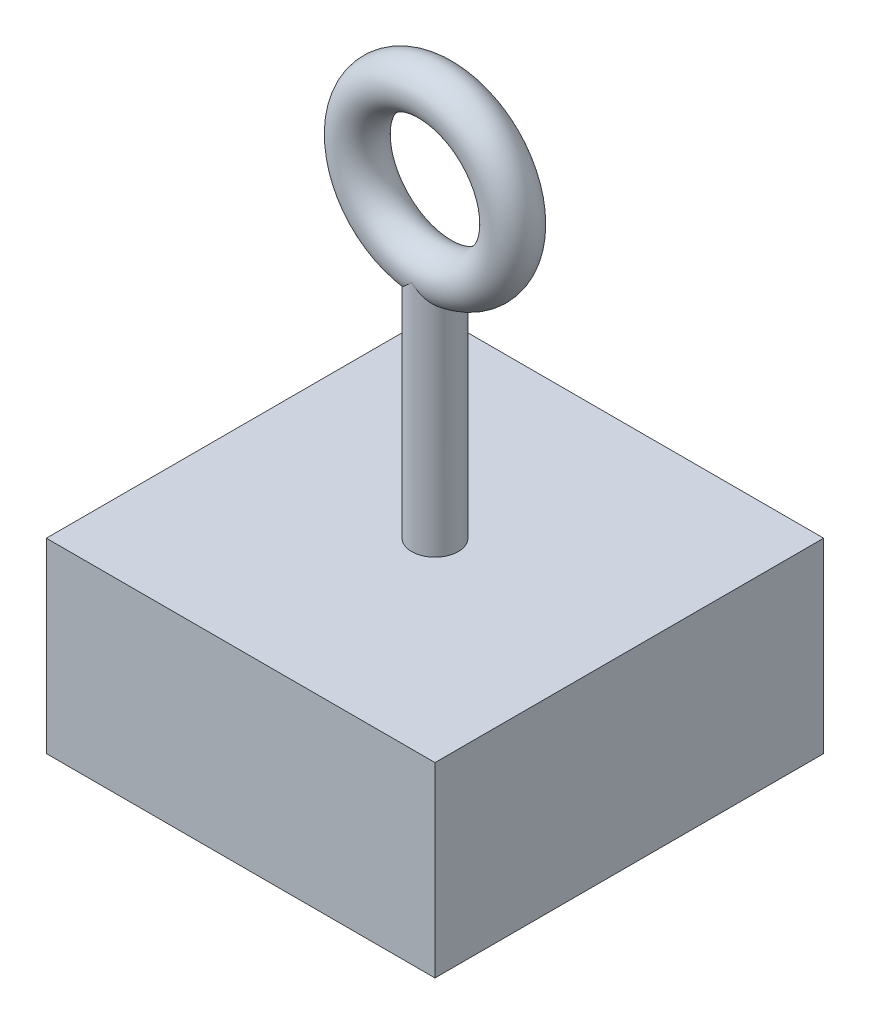
ISO-10303-21;
HEADER;
FILE_DESCRIPTION(('STEP AP214'),'2;1');
FILE_NAME('part.step','',(''),(''),'','','');
FILE_SCHEMA(('AUTOMOTIVE_DESIGN { 1 0 10303 214 1 1 1 1 }'));
ENDSEC;
DATA;
#1=APPLICATION_CONTEXT('core data for automotive mechanical design processes');
#2=APPLICATION_PROTOCOL_DEFINITION('international standard','automotive_design',2000,#1);
#3=PRODUCT_CONTEXT('',#1,'mechanical');
#4=PRODUCT('Part','Part','',(#3));
#5=PRODUCT_RELATED_PRODUCT_CATEGORY('part','',(#4));
#6=PRODUCT_DEFINITION_FORMATION('','',#4);
#7=PRODUCT_DEFINITION_CONTEXT('part definition',#1,'design');
#8=PRODUCT_DEFINITION('design','',#6,#7);
#9=PRODUCT_DEFINITION_SHAPE('','',#8);
#10=(LENGTH_UNIT() NAMED_UNIT(*) SI_UNIT(.MILLI.,.METRE.));
#11=(NAMED_UNIT(*) PLANE_ANGLE_UNIT() SI_UNIT($,.RADIAN.));
#12=(NAMED_UNIT(*) SI_UNIT($,.STERADIAN.) SOLID_ANGLE_UNIT());
#13=UNCERTAINTY_MEASURE_WITH_UNIT(LENGTH_MEASURE(1.E-05),#10,'distance_accuracy_value','');
#14=(GEOMETRIC_REPRESENTATION_CONTEXT(3) GLOBAL_UNCERTAINTY_ASSIGNED_CONTEXT((#13)) GLOBAL_UNIT_ASSIGNED_CONTEXT((#10,
#11,#12)) REPRESENTATION_CONTEXT('',''));
#15=CARTESIAN_POINT('',(0.,0.,0.));
#16=DIRECTION('',(0.,0.,1.));
#17=DIRECTION('',(1.,0.,0.));
#18=AXIS2_PLACEMENT_3D('',#15,#16,#17);
#19=CARTESIAN_POINT('',(-12.5,12.,12.5));
#20=DIRECTION('',(1.,0.,0.));
#21=DIRECTION('',(0.,0.,-1.));
#22=AXIS2_PLACEMENT_3D('',#19,#20,#21);
#23=PLANE('',#22);
#24=DIRECTION('',(0.,0.,1.));
#25=VECTOR('',#24,1.);
#26=CARTESIAN_POINT('',(-12.5,0.,12.5));
#27=LINE('',#26,#25);
#28=CARTESIAN_POINT('',(-12.5,0.,-12.5));
#29=VERTEX_POINT('',#28);
#30=CARTESIAN_POINT('',(-12.5,0.,12.5));
#31=VERTEX_POINT('',#30);
#32=EDGE_CURVE('E104',#29,#31,#27,.T.);
#33=ORIENTED_EDGE('',*,*,#32,.T.);
#34=DIRECTION('',(0.,-1.,0.));
#35=VECTOR('',#34,1.);
#36=CARTESIAN_POINT('',(-12.5,12.,12.5));
#37=LINE('',#36,#35);
#38=CARTESIAN_POINT('',(-12.5,12.,12.5));
#39=VERTEX_POINT('',#38);
#40=EDGE_CURVE('E11',#39,#31,#37,.T.);
#41=ORIENTED_EDGE('',*,*,#40,.F.);
#42=DIRECTION('',(0.,0.,1.));
#43=VECTOR('',#42,1.);
#44=CARTESIAN_POINT('',(-12.5,12.,12.5));
#45=LINE('',#44,#43);
#46=CARTESIAN_POINT('',(-12.5,12.,-12.5));
#47=VERTEX_POINT('',#46);
#48=EDGE_CURVE('E152',#47,#39,#45,.T.);
#49=ORIENTED_EDGE('',*,*,#48,.F.);
#50=DIRECTION('',(0.,-1.,0.));
#51=VECTOR('',#50,1.);
#52=CARTESIAN_POINT('',(-12.5,12.,-12.5));
#53=LINE('',#52,#51);
#54=EDGE_CURVE('E137',#47,#29,#53,.T.);
#55=ORIENTED_EDGE('',*,*,#54,.T.);
#56=EDGE_LOOP('',(#33,#41,#49,#55));
#57=FACE_BOUND('',#56,.T.);
#58=ADVANCED_FACE('F39',(#57),#23,.F.);
#59=CARTESIAN_POINT('',(12.5,12.,12.5));
#60=DIRECTION('',(0.,0.,-1.));
#61=DIRECTION('',(-1.,0.,0.));
#62=AXIS2_PLACEMENT_3D('',#59,#60,#61);
#63=PLANE('',#62);
#64=DIRECTION('',(1.,0.,0.));
#65=VECTOR('',#64,1.);
#66=CARTESIAN_POINT('',(12.5,0.,12.5));
#67=LINE('',#66,#65);
#68=CARTESIAN_POINT('',(12.5,0.,12.5));
#69=VERTEX_POINT('',#68);
#70=EDGE_CURVE('E140',#31,#69,#67,.T.);
#71=ORIENTED_EDGE('',*,*,#70,.T.);
#72=DIRECTION('',(0.,-1.,0.));
#73=VECTOR('',#72,1.);
#74=CARTESIAN_POINT('',(12.5,12.,12.5));
#75=LINE('',#74,#73);
#76=CARTESIAN_POINT('',(12.5,12.,12.5));
#77=VERTEX_POINT('',#76);
#78=EDGE_CURVE('E47',#77,#69,#75,.T.);
#79=ORIENTED_EDGE('',*,*,#78,.F.);
#80=DIRECTION('',(1.,0.,0.));
#81=VECTOR('',#80,1.);
#82=CARTESIAN_POINT('',(12.5,12.,12.5));
#83=LINE('',#82,#81);
#84=EDGE_CURVE('E90',#39,#77,#83,.T.);
#85=ORIENTED_EDGE('',*,*,#84,.F.);
#86=ORIENTED_EDGE('',*,*,#40,.T.);
#87=EDGE_LOOP('',(#71,#79,#85,#86));
#88=FACE_BOUND('',#87,.T.);
#89=ADVANCED_FACE('F127',(#88),#63,.F.);
#90=CARTESIAN_POINT('',(12.5,12.,12.5));
#91=DIRECTION('',(-1.,0.,0.));
#92=DIRECTION('',(0.,0.,1.));
#93=AXIS2_PLACEMENT_3D('',#90,#91,#92);
#94=PLANE('',#93);
#95=DIRECTION('',(0.,0.,-1.));
#96=VECTOR('',#95,1.);
#97=CARTESIAN_POINT('',(12.5,0.,12.5));
#98=LINE('',#97,#96);
#99=CARTESIAN_POINT('',(12.5,0.,-12.5));
#100=VERTEX_POINT('',#99);
#101=EDGE_CURVE('E143',#69,#100,#98,.T.);
#102=ORIENTED_EDGE('',*,*,#101,.T.);
#103=DIRECTION('',(0.,-1.,0.));
#104=VECTOR('',#103,1.);
#105=CARTESIAN_POINT('',(12.5,12.,-12.5));
#106=LINE('',#105,#104);
#107=CARTESIAN_POINT('',(12.5,12.,-12.5));
#108=VERTEX_POINT('',#107);
#109=EDGE_CURVE('E155',#108,#100,#106,.T.);
#110=ORIENTED_EDGE('',*,*,#109,.F.);
#111=DIRECTION('',(0.,0.,-1.));
#112=VECTOR('',#111,1.);
#113=CARTESIAN_POINT('',(12.5,12.,12.5));
#114=LINE('',#113,#112);
#115=EDGE_CURVE('E163',#77,#108,#114,.T.);
#116=ORIENTED_EDGE('',*,*,#115,.F.);
#117=ORIENTED_EDGE('',*,*,#78,.T.);
#118=EDGE_LOOP('',(#102,#110,#116,#117));
#119=FACE_BOUND('',#118,.T.);
#120=ADVANCED_FACE('F132',(#119),#94,.F.);
#121=CARTESIAN_POINT('',(12.5,12.,-12.5));
#122=DIRECTION('',(0.,0.,1.));
#123=DIRECTION('',(1.,0.,0.));
#124=AXIS2_PLACEMENT_3D('',#121,#122,#123);
#125=PLANE('',#124);
#126=DIRECTION('',(-1.,0.,0.));
#127=VECTOR('',#126,1.);
#128=CARTESIAN_POINT('',(12.5,0.,-12.5));
#129=LINE('',#128,#127);
#130=EDGE_CURVE('E83',#100,#29,#129,.T.);
#131=ORIENTED_EDGE('',*,*,#130,.T.);
#132=ORIENTED_EDGE('',*,*,#54,.F.);
#133=DIRECTION('',(-1.,0.,0.));
#134=VECTOR('',#133,1.);
#135=CARTESIAN_POINT('',(12.5,12.,-12.5));
#136=LINE('',#135,#134);
#137=EDGE_CURVE('E62',#108,#47,#136,.T.);
#138=ORIENTED_EDGE('',*,*,#137,.F.);
#139=ORIENTED_EDGE('',*,*,#109,.T.);
#140=EDGE_LOOP('',(#131,#132,#138,#139));
#141=FACE_BOUND('',#140,.T.);
#142=ADVANCED_FACE('F170',(#141),#125,.F.);
#143=CARTESIAN_POINT('',(0.,12.,0.));
#144=DIRECTION('',(0.,1.,0.));
#145=DIRECTION('',(0.,0.,1.));
#146=AXIS2_PLACEMENT_3D('',#143,#144,#145);
#147=PLANE('',#146);
#148=CARTESIAN_POINT('',(0.,12.,0.));
#149=DIRECTION('',(0.,1.,0.));
#150=DIRECTION('',(0.,0.,1.));
#151=AXIS2_PLACEMENT_3D('',#148,#149,#150);
#152=CIRCLE('',#151,1.5);
#153=CARTESIAN_POINT('',(0.,12.,1.5));
#154=VERTEX_POINT('',#153);
#155=EDGE_CURVE('E100',#154,#154,#152,.T.);
#156=ORIENTED_EDGE('',*,*,#155,.F.);
#157=EDGE_LOOP('',(#156));
#158=FACE_BOUND('',#157,.T.);
#159=ORIENTED_EDGE('',*,*,#48,.T.);
#160=ORIENTED_EDGE('',*,*,#84,.T.);
#161=ORIENTED_EDGE('',*,*,#115,.T.);
#162=ORIENTED_EDGE('',*,*,#137,.T.);
#163=EDGE_LOOP('',(#159,#160,#161,#162));
#164=FACE_BOUND('',#163,.T.);
#165=ADVANCED_FACE('F165',(#158,#164),#147,.T.);
#166=CARTESIAN_POINT('',(0.,0.,0.));
#167=DIRECTION('',(0.,1.,0.));
#168=DIRECTION('',(0.,0.,1.));
#169=AXIS2_PLACEMENT_3D('',#166,#167,#168);
#170=PLANE('',#169);
#171=ORIENTED_EDGE('',*,*,#32,.F.);
#172=ORIENTED_EDGE('',*,*,#130,.F.);
#173=ORIENTED_EDGE('',*,*,#101,.F.);
#174=ORIENTED_EDGE('',*,*,#70,.F.);
#175=EDGE_LOOP('',(#171,#172,#173,#174));
#176=FACE_BOUND('',#175,.T.);
#177=ADVANCED_FACE('F125',(#176),#170,.F.);
#178=CARTESIAN_POINT('',(0.,27.,0.));
#179=DIRECTION('',(0.,-1.,0.));
#180=DIRECTION('',(0.,0.,-1.));
#181=AXIS2_PLACEMENT_3D('',#178,#179,#180);
#182=CYLINDRICAL_SURFACE('',#181,1.5);
#183=CARTESIAN_POINT('',(0.,26.999999906,-1.50000000000002));
#184=CARTESIAN_POINT('',(0.00182568963583566,26.9981742102942,-1.49999999734486));
#185=CARTESIAN_POINT('',(0.00365193432677595,26.9963489657987,-1.49999666428704));
#186=CARTESIAN_POINT('',(0.0949131750784535,26.9051878507825,-1.49966346032787));
#187=CARTESIAN_POINT('',(0.185655647360203,26.8169499783912,-1.49133942554492));
#188=CARTESIAN_POINT('',(0.367724582442865,26.6441881953785,-1.45718060292192));
#189=CARTESIAN_POINT('',(0.459051776626769,26.5596708658237,-1.43131601718542));
#190=CARTESIAN_POINT('',(0.628438957786914,26.4062946842608,-1.3646638731951));
#191=CARTESIAN_POINT('',(0.706760542964749,26.3367821829243,-1.32607642679257));
#192=CARTESIAN_POINT('',(0.859003198743123,26.2039299155861,-1.2329046127736));
#193=CARTESIAN_POINT('',(0.932930737295943,26.1405809847345,-1.17834449528794));
#194=CARTESIAN_POINT('',(1.05828674399811,26.0346779581032,-1.06563374382396));
#195=CARTESIAN_POINT('',(1.11118877923404,25.9905445548412,-1.01061522778142));
#196=CARTESIAN_POINT('',(1.20984551442828,25.9090136999866,-0.890121431120688));
#197=CARTESIAN_POINT('',(1.25560795085607,25.8716089504015,-0.824657626869593));
#198=CARTESIAN_POINT('',(1.33071822817451,25.8106576573649,-0.695570345171387));
#199=CARTESIAN_POINT('',(1.36152672735676,25.7858449802986,-0.633398746028195));
#200=CARTESIAN_POINT('',(1.41477797907457,25.7431446830224,-0.503321177727648));
#201=CARTESIAN_POINT('',(1.43722443657645,25.7252539957535,-0.435417764559651));
#202=CARTESIAN_POINT('',(1.47245202060871,25.6972449045988,-0.295186793571588));
#203=CARTESIAN_POINT('',(1.48518253236534,25.6871671978303,-0.222838160969745));
#204=CARTESIAN_POINT('',(1.49985819047012,25.6755538542848,-0.0763806352275474));
#205=CARTESIAN_POINT('',(1.50180734814341,25.674015040515,-0.0022724070727229));
#206=CARTESIAN_POINT('',(1.49511135607249,25.6793103170989,0.138366612430237));
#207=CARTESIAN_POINT('',(1.48741234238786,25.6853966426296,0.204974299762338));
#208=CARTESIAN_POINT('',(1.46347911866601,25.7043760013652,0.335617584354094));
#209=CARTESIAN_POINT('',(1.44724496675342,25.7172689882166,0.399653199126464));
#210=CARTESIAN_POINT('',(1.40688370679557,25.7494721311657,0.524441138036077));
#211=CARTESIAN_POINT('',(1.38265491168221,25.7688650150094,0.585138746008906));
#212=CARTESIAN_POINT('',(1.32756220644451,25.8132306918863,0.701221691754634));
#213=CARTESIAN_POINT('',(1.29669630268246,25.838205161591,0.756605426114912));
#214=CARTESIAN_POINT('',(1.22541017424457,25.89630891705,0.867906278731232));
#215=CARTESIAN_POINT('',(1.18427985829053,25.9300653405413,0.923038306226988));
#216=CARTESIAN_POINT('',(1.09686884122815,26.0025000301075,1.02538685867852));
#217=CARTESIAN_POINT('',(1.0505845310859,26.0411817478249,1.07259777822783));
#218=CARTESIAN_POINT('',(0.930175018903906,26.1429138523676,1.18076357991972));
#219=CARTESIAN_POINT('',(0.853707660471543,26.2084725469941,1.23677463233508));
#220=CARTESIAN_POINT('',(0.696174115013345,26.346107412551,1.33185663766157));
#221=CARTESIAN_POINT('',(0.615098127813316,26.418197681872,1.37088983809151));
#222=CARTESIAN_POINT('',(0.445515047403088,26.5721568043537,1.43537760819614));
#223=CARTESIAN_POINT('',(0.356884072533818,26.6543569901975,1.45969517804686));
#224=CARTESIAN_POINT('',(0.180252860107695,26.8222052321371,1.49182713382793));
#225=CARTESIAN_POINT('',(0.0922517374151249,26.9078463542816,1.49967316426294));
#226=CARTESIAN_POINT('',(0.00365193571746469,26.9963489645857,1.49999666456257));
#227=CARTESIAN_POINT('',(0.00182569104588028,26.998174209106,1.49999999763108));
#228=CARTESIAN_POINT('',(0.,26.999999906,1.50000000000002));
#229=B_SPLINE_CURVE_WITH_KNOTS('',3,(#183,#184,#185,#186,#187,#188,#189,#190,#191,#192,#193,
#194,#195,#196,#197,#198,#199,#200,#201,#202,#203,#204,#205,#206,#207,#208,#209,#210,#211,#212,
#213,#214,#215,#216,#217,#218,#219,#220,#221,#222,#223,#224,#225,#226,#227,#228),.UNSPECIFIED.,
.F.,.F.,(4,2,2,2,2,2,2,2,2,2,2,2,2,2,2,2,2,2,2,2,2,2,4),(0.,0.00774597344465398,
0.386966746084224,0.766833358281173,1.10045393892643,1.43357061177684,1.69708534297103,
1.96031251607551,2.1804647055462,2.40051923593788,2.62171244971653,2.84282336051105,
3.04385215262425,3.24487957574144,3.44856941372013,3.65232052121314,3.88133136465765,
4.11050359127406,4.45435145777399,4.79896005423369,5.16760494395127,5.53554095635558,
5.54328692980489),.UNSPECIFIED.);
#230=CARTESIAN_POINT('',(0.,27.,-1.5));
#231=VERTEX_POINT('',#230);
#232=CARTESIAN_POINT('',(0.,27.,1.5));
#233=VERTEX_POINT('',#232);
#234=EDGE_CURVE('E92',#231,#233,#229,.T.);
#235=ORIENTED_EDGE('',*,*,#234,.T.);
#236=CARTESIAN_POINT('',(0.,26.999999906,1.50000000000002));
#237=CARTESIAN_POINT('',(-0.00182568963583565,26.9981742102942,1.49999999734486));
#238=CARTESIAN_POINT('',(-0.00365193432677593,26.9963489657987,1.49999666428704));
#239=CARTESIAN_POINT('',(-0.094913175078453,26.9051878507825,1.49966346032787));
#240=CARTESIAN_POINT('',(-0.185655647360201,26.8169499783912,1.49133942554492));
#241=CARTESIAN_POINT('',(-0.367724582442864,26.6441881953785,1.45718060292192));
#242=CARTESIAN_POINT('',(-0.459051776626767,26.5596708658237,1.43131601718542));
#243=CARTESIAN_POINT('',(-0.628438957786911,26.4062946842608,1.3646638731951));
#244=CARTESIAN_POINT('',(-0.706760542964746,26.3367821829243,1.32607642679257));
#245=CARTESIAN_POINT('',(-0.85900319874312,26.2039299155861,1.2329046127736));
#246=CARTESIAN_POINT('',(-0.93293073729594,26.1405809847345,1.17834449528794));
#247=CARTESIAN_POINT('',(-1.0582867439981,26.0346779581032,1.06563374382397));
#248=CARTESIAN_POINT('',(-1.11118877923403,25.9905445548412,1.01061522778143));
#249=CARTESIAN_POINT('',(-1.20984551442828,25.9090136999866,0.890121431120693));
#250=CARTESIAN_POINT('',(-1.25560795085607,25.8716089504015,0.824657626869598));
#251=CARTESIAN_POINT('',(-1.33071822817451,25.8106576573649,0.695570345171391));
#252=CARTESIAN_POINT('',(-1.36152672735676,25.7858449802986,0.633398746028199));
#253=CARTESIAN_POINT('',(-1.41477797907457,25.7431446830224,0.503321177727652));
#254=CARTESIAN_POINT('',(-1.43722443657645,25.7252539957535,0.435417764559656));
#255=CARTESIAN_POINT('',(-1.47245202060871,25.6972449045988,0.295186793571593));
#256=CARTESIAN_POINT('',(-1.48518253236534,25.6871671978303,0.22283816096975));
#257=CARTESIAN_POINT('',(-1.49985819047012,25.6755538542848,0.0763806352275517));
#258=CARTESIAN_POINT('',(-1.50180734814341,25.674015040515,0.00227240707272715));
#259=CARTESIAN_POINT('',(-1.49511135607249,25.6793103170989,-0.138366612430233));
#260=CARTESIAN_POINT('',(-1.48741234238786,25.6853966426296,-0.204974299762334));
#261=CARTESIAN_POINT('',(-1.46347911866601,25.7043760013652,-0.33561758435409));
#262=CARTESIAN_POINT('',(-1.44724496675342,25.7172689882166,-0.399653199126461));
#263=CARTESIAN_POINT('',(-1.40688370679557,25.7494721311657,-0.524441138036074));
#264=CARTESIAN_POINT('',(-1.38265491168221,25.7688650150094,-0.585138746008903));
#265=CARTESIAN_POINT('',(-1.32756220644452,25.8132306918863,-0.701221691754631));
#266=CARTESIAN_POINT('',(-1.29669630268246,25.838205161591,-0.756605426114909));
#267=CARTESIAN_POINT('',(-1.22541017424457,25.89630891705,-0.867906278731229));
#268=CARTESIAN_POINT('',(-1.18427985829053,25.9300653405413,-0.923038306226985));
#269=CARTESIAN_POINT('',(-1.09686884122815,26.0025000301075,-1.02538685867851));
#270=CARTESIAN_POINT('',(-1.0505845310859,26.0411817478249,-1.07259777822782));
#271=CARTESIAN_POINT('',(-0.93017501890391,26.1429138523676,-1.18076357991971));
#272=CARTESIAN_POINT('',(-0.853707660471547,26.208472546994,-1.23677463233508));
#273=CARTESIAN_POINT('',(-0.69617411501335,26.346107412551,-1.33185663766157));
#274=CARTESIAN_POINT('',(-0.615098127813321,26.418197681872,-1.37088983809151));
#275=CARTESIAN_POINT('',(-0.445515047403093,26.5721568043537,-1.43537760819614));
#276=CARTESIAN_POINT('',(-0.356884072533822,26.6543569901975,-1.45969517804686));
#277=CARTESIAN_POINT('',(-0.180252860107698,26.8222052321371,-1.49182713382793));
#278=CARTESIAN_POINT('',(-0.0922517374151254,26.9078463542816,-1.49967316426294));
#279=CARTESIAN_POINT('',(-0.00365193571746457,26.9963489645857,-1.49999666456257));
#280=CARTESIAN_POINT('',(-0.00182569104588023,26.998174209106,-1.49999999763108));
#281=CARTESIAN_POINT('',(0.,26.999999906,-1.50000000000002));
#282=B_SPLINE_CURVE_WITH_KNOTS('',3,(#236,#237,#238,#239,#240,#241,#242,#243,#244,#245,#246,
#247,#248,#249,#250,#251,#252,#253,#254,#255,#256,#257,#258,#259,#260,#261,#262,#263,#264,#265,
#266,#267,#268,#269,#270,#271,#272,#273,#274,#275,#276,#277,#278,#279,#280,#281),.UNSPECIFIED.,
.F.,.F.,(4,2,2,2,2,2,2,2,2,2,2,2,2,2,2,2,2,2,2,2,2,2,4),(0.,0.00774597344465396,
0.386966746084224,0.766833358281168,1.10045393892643,1.43357061177683,1.69708534297103,
1.96031251607551,2.1804647055462,2.40051923593787,2.62171244971652,2.84282336051105,
3.04385215262424,3.24487957574143,3.44856941372013,3.65232052121314,3.88133136465765,
4.11050359127405,4.45435145777398,4.79896005423368,5.16760494395126,5.53554095635558,
5.54328692980489),.UNSPECIFIED.);
#283=EDGE_CURVE('E53',#233,#231,#282,.T.);
#284=ORIENTED_EDGE('',*,*,#283,.T.);
#285=EDGE_LOOP('',(#235,#284));
#286=FACE_BOUND('',#285,.T.);
#287=ORIENTED_EDGE('',*,*,#155,.T.);
#288=EDGE_LOOP('',(#287));
#289=FACE_BOUND('',#288,.T.);
#290=ADVANCED_FACE('F97',(#286,#289),#182,.T.);
#291=CARTESIAN_POINT('',(0.,31.999999906,0.));
#292=DIRECTION('',(0.,0.,-1.));
#293=DIRECTION('',(-1.,0.,0.));
#294=AXIS2_PLACEMENT_3D('',#291,#292,#293);
#295=TOROIDAL_SURFACE('',#294,5.,1.5);
#296=ORIENTED_EDGE('',*,*,#283,.F.);
#297=ORIENTED_EDGE('',*,*,#234,.F.);
#298=EDGE_LOOP('',(#296,#297));
#299=FACE_BOUND('',#298,.T.);
#300=ADVANCED_FACE('F93',(#299),#295,.T.);
#301=CLOSED_SHELL('',(#58,#89,#120,#142,#165,#177,#290,#300));
#302=MANIFOLD_SOLID_BREP('B2',#301);
#303=ADVANCED_BREP_SHAPE_REPRESENTATION('',(#18,#302),#14);
#304=SHAPE_DEFINITION_REPRESENTATION(#9,#303);
ENDSEC;
END-ISO-10303-21;
